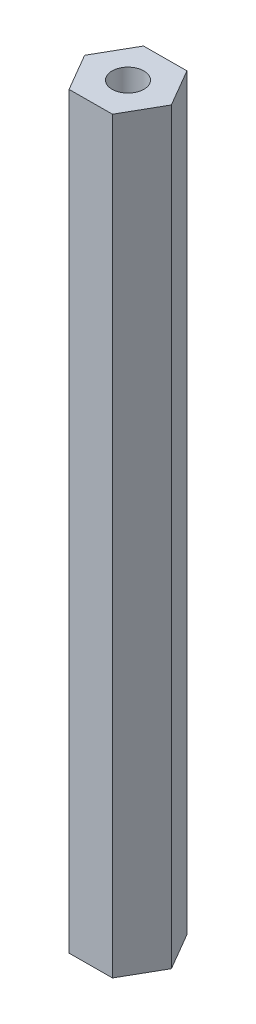
ISO-10303-21;
HEADER;
FILE_DESCRIPTION(('STEP AP214'),'2;1');
FILE_NAME('part.step','',(''),(''),'','','');
FILE_SCHEMA(('AUTOMOTIVE_DESIGN { 1 0 10303 214 1 1 1 1 }'));
ENDSEC;
DATA;
#1=APPLICATION_CONTEXT('core data for automotive mechanical design processes');
#2=APPLICATION_PROTOCOL_DEFINITION('international standard','automotive_design',2000,#1);
#3=PRODUCT_CONTEXT('',#1,'mechanical');
#4=PRODUCT('Part','Part','',(#3));
#5=PRODUCT_RELATED_PRODUCT_CATEGORY('part','',(#4));
#6=PRODUCT_DEFINITION_FORMATION('','',#4);
#7=PRODUCT_DEFINITION_CONTEXT('part definition',#1,'design');
#8=PRODUCT_DEFINITION('design','',#6,#7);
#9=PRODUCT_DEFINITION_SHAPE('','',#8);
#10=(LENGTH_UNIT() NAMED_UNIT(*) SI_UNIT(.MILLI.,.METRE.));
#11=(NAMED_UNIT(*) PLANE_ANGLE_UNIT() SI_UNIT($,.RADIAN.));
#12=(NAMED_UNIT(*) SI_UNIT($,.STERADIAN.) SOLID_ANGLE_UNIT());
#13=UNCERTAINTY_MEASURE_WITH_UNIT(LENGTH_MEASURE(1.E-05),#10,'distance_accuracy_value','');
#14=(GEOMETRIC_REPRESENTATION_CONTEXT(3) GLOBAL_UNCERTAINTY_ASSIGNED_CONTEXT((#13)) GLOBAL_UNIT_ASSIGNED_CONTEXT((#10,
#11,#12)) REPRESENTATION_CONTEXT('',''));
#15=CARTESIAN_POINT('',(0.,0.,0.));
#16=DIRECTION('',(0.,0.,1.));
#17=DIRECTION('',(1.,0.,0.));
#18=AXIS2_PLACEMENT_3D('',#15,#16,#17);
#19=CARTESIAN_POINT('',(1.81885853104389,63.5,-3.18317247056803));
#20=DIRECTION('',(0.00447565788556657,0.,0.999989984193087));
#21=DIRECTION('',(0.999989984193088,0.,-0.00447565788556657));
#22=AXIS2_PLACEMENT_3D('',#19,#20,#21);
#23=PLANE('',#22);
#24=DIRECTION('',(-0.999989984193087,0.,0.00447565788556657));
#25=VECTOR('',#24,1.);
#26=CARTESIAN_POINT('',(1.81885853104389,0.,-3.18317247056803));
#27=LINE('',#26,#25);
#28=CARTESIAN_POINT('',(1.81885853104389,0.,-3.18317247056803));
#29=VERTEX_POINT('',#28);
#30=CARTESIAN_POINT('',(-1.84727895861724,0.,-3.16676392905808));
#31=VERTEX_POINT('',#30);
#32=EDGE_CURVE('E116',#29,#31,#27,.T.);
#33=ORIENTED_EDGE('',*,*,#32,.T.);
#34=DIRECTION('',(0.,-1.,0.));
#35=VECTOR('',#34,1.);
#36=CARTESIAN_POINT('',(-1.84727895861724,63.5,-3.16676392905808));
#37=LINE('',#36,#35);
#38=CARTESIAN_POINT('',(-1.84727895861724,63.5,-3.16676392905808));
#39=VERTEX_POINT('',#38);
#40=EDGE_CURVE('E11',#39,#31,#37,.T.);
#41=ORIENTED_EDGE('',*,*,#40,.F.);
#42=DIRECTION('',(-0.999989984193087,0.,0.00447565788556657));
#43=VECTOR('',#42,1.);
#44=CARTESIAN_POINT('',(1.81885853104389,63.5,-3.18317247056803));
#45=LINE('',#44,#43);
#46=CARTESIAN_POINT('',(1.81885853104389,63.5,-3.18317247056803));
#47=VERTEX_POINT('',#46);
#48=EDGE_CURVE('E127',#47,#39,#45,.T.);
#49=ORIENTED_EDGE('',*,*,#48,.F.);
#50=DIRECTION('',(0.,-1.,0.));
#51=VECTOR('',#50,1.);
#52=CARTESIAN_POINT('',(1.81885853104389,63.5,-3.18317247056803));
#53=LINE('',#52,#51);
#54=EDGE_CURVE('E112',#47,#29,#53,.T.);
#55=ORIENTED_EDGE('',*,*,#54,.T.);
#56=EDGE_LOOP('',(#33,#41,#49,#55));
#57=FACE_BOUND('',#56,.T.);
#58=ADVANCED_FACE('F32',(#57),#23,.F.);
#59=CARTESIAN_POINT('',(-1.84727895861724,63.5,-3.16676392905808));
#60=DIRECTION('',(0.868254558783996,0.,0.496118958668995));
#61=DIRECTION('',(0.496118958668995,0.,-0.868254558783996));
#62=AXIS2_PLACEMENT_3D('',#59,#60,#61);
#63=PLANE('',#62);
#64=DIRECTION('',(-0.496118958668995,0.,0.868254558783996));
#65=VECTOR('',#64,1.);
#66=CARTESIAN_POINT('',(-1.84727895861724,0.,-3.16676392905808));
#67=LINE('',#66,#65);
#68=CARTESIAN_POINT('',(-3.66613748966113,0.,0.0164085415099574));
#69=VERTEX_POINT('',#68);
#70=EDGE_CURVE('E119',#31,#69,#67,.T.);
#71=ORIENTED_EDGE('',*,*,#70,.T.);
#72=DIRECTION('',(0.,-1.,0.));
#73=VECTOR('',#72,1.);
#74=CARTESIAN_POINT('',(-3.66613748966113,63.5,0.0164085415099574));
#75=LINE('',#74,#73);
#76=CARTESIAN_POINT('',(-3.66613748966113,63.5,0.0164085415099574));
#77=VERTEX_POINT('',#76);
#78=EDGE_CURVE('E40',#77,#69,#75,.T.);
#79=ORIENTED_EDGE('',*,*,#78,.F.);
#80=DIRECTION('',(-0.496118958668995,0.,0.868254558783996));
#81=VECTOR('',#80,1.);
#82=CARTESIAN_POINT('',(-1.84727895861724,63.5,-3.16676392905808));
#83=LINE('',#82,#81);
#84=EDGE_CURVE('E85',#39,#77,#83,.T.);
#85=ORIENTED_EDGE('',*,*,#84,.F.);
#86=ORIENTED_EDGE('',*,*,#40,.T.);
#87=EDGE_LOOP('',(#71,#79,#85,#86));
#88=FACE_BOUND('',#87,.T.);
#89=ADVANCED_FACE('F152',(#88),#63,.F.);
#90=CARTESIAN_POINT('',(-3.66613748966113,63.5,0.0164085415099574));
#91=DIRECTION('',(0.863778900898429,0.,-0.503871025524093));
#92=DIRECTION('',(-0.503871025524093,0.,-0.86377890089843));
#93=AXIS2_PLACEMENT_3D('',#90,#91,#92);
#94=PLANE('',#93);
#95=DIRECTION('',(0.503871025524093,0.,0.86377890089843));
#96=VECTOR('',#95,1.);
#97=CARTESIAN_POINT('',(-3.66613748966113,0.,0.0164085415099574));
#98=LINE('',#97,#96);
#99=CARTESIAN_POINT('',(-1.81885853104389,0.,3.18317247056804));
#100=VERTEX_POINT('',#99);
#101=EDGE_CURVE('E122',#69,#100,#98,.T.);
#102=ORIENTED_EDGE('',*,*,#101,.T.);
#103=DIRECTION('',(0.,-1.,0.));
#104=VECTOR('',#103,1.);
#105=CARTESIAN_POINT('',(-1.81885853104389,63.5,3.18317247056804));
#106=LINE('',#105,#104);
#107=CARTESIAN_POINT('',(-1.81885853104389,63.5,3.18317247056804));
#108=VERTEX_POINT('',#107);
#109=EDGE_CURVE('E107',#108,#100,#106,.T.);
#110=ORIENTED_EDGE('',*,*,#109,.F.);
#111=DIRECTION('',(0.503871025524093,0.,0.86377890089843));
#112=VECTOR('',#111,1.);
#113=CARTESIAN_POINT('',(-3.66613748966113,63.5,0.0164085415099574));
#114=LINE('',#113,#112);
#115=EDGE_CURVE('E98',#77,#108,#114,.T.);
#116=ORIENTED_EDGE('',*,*,#115,.F.);
#117=ORIENTED_EDGE('',*,*,#78,.T.);
#118=EDGE_LOOP('',(#102,#110,#116,#117));
#119=FACE_BOUND('',#118,.T.);
#120=ADVANCED_FACE('F133',(#119),#94,.F.);
#121=CARTESIAN_POINT('',(-1.81885853104389,63.5,3.18317247056804));
#122=DIRECTION('',(-0.00447565788556681,0.,-0.999989984193087));
#123=DIRECTION('',(-0.999989984193088,0.,0.00447565788556681));
#124=AXIS2_PLACEMENT_3D('',#121,#122,#123);
#125=PLANE('',#124);
#126=DIRECTION('',(0.999989984193087,0.,-0.00447565788556681));
#127=VECTOR('',#126,1.);
#128=CARTESIAN_POINT('',(-1.81885853104389,0.,3.18317247056804));
#129=LINE('',#128,#127);
#130=CARTESIAN_POINT('',(1.84727895861724,0.,3.16676392905808));
#131=VERTEX_POINT('',#130);
#132=EDGE_CURVE('E106',#100,#131,#129,.T.);
#133=ORIENTED_EDGE('',*,*,#132,.T.);
#134=DIRECTION('',(0.,-1.,0.));
#135=VECTOR('',#134,1.);
#136=CARTESIAN_POINT('',(1.84727895861724,63.5,3.16676392905808));
#137=LINE('',#136,#135);
#138=CARTESIAN_POINT('',(1.84727895861724,63.5,3.16676392905808));
#139=VERTEX_POINT('',#138);
#140=EDGE_CURVE('E103',#139,#131,#137,.T.);
#141=ORIENTED_EDGE('',*,*,#140,.F.);
#142=DIRECTION('',(0.999989984193087,0.,-0.00447565788556681));
#143=VECTOR('',#142,1.);
#144=CARTESIAN_POINT('',(-1.81885853104389,63.5,3.18317247056804));
#145=LINE('',#144,#143);
#146=EDGE_CURVE('E92',#108,#139,#145,.T.);
#147=ORIENTED_EDGE('',*,*,#146,.F.);
#148=ORIENTED_EDGE('',*,*,#109,.T.);
#149=EDGE_LOOP('',(#133,#141,#147,#148));
#150=FACE_BOUND('',#149,.T.);
#151=ADVANCED_FACE('F104',(#150),#125,.F.);
#152=CARTESIAN_POINT('',(1.84727895861724,63.5,3.16676392905808));
#153=DIRECTION('',(-0.868254558783996,0.,-0.496118958668995));
#154=DIRECTION('',(-0.496118958668995,0.,0.868254558783997));
#155=AXIS2_PLACEMENT_3D('',#152,#153,#154);
#156=PLANE('',#155);
#157=DIRECTION('',(0.496118958668995,0.,-0.868254558783996));
#158=VECTOR('',#157,1.);
#159=CARTESIAN_POINT('',(1.84727895861724,0.,3.16676392905808));
#160=LINE('',#159,#158);
#161=CARTESIAN_POINT('',(3.66613748966114,0.,-0.0164085415099599));
#162=VERTEX_POINT('',#161);
#163=EDGE_CURVE('E71',#131,#162,#160,.T.);
#164=ORIENTED_EDGE('',*,*,#163,.T.);
#165=DIRECTION('',(0.,-1.,0.));
#166=VECTOR('',#165,1.);
#167=CARTESIAN_POINT('',(3.66613748966114,63.5,-0.0164085415099599));
#168=LINE('',#167,#166);
#169=CARTESIAN_POINT('',(3.66613748966114,63.5,-0.0164085415099599));
#170=VERTEX_POINT('',#169);
#171=EDGE_CURVE('E108',#170,#162,#168,.T.);
#172=ORIENTED_EDGE('',*,*,#171,.F.);
#173=DIRECTION('',(0.496118958668995,0.,-0.868254558783996));
#174=VECTOR('',#173,1.);
#175=CARTESIAN_POINT('',(1.84727895861724,63.5,3.16676392905808));
#176=LINE('',#175,#174);
#177=EDGE_CURVE('E96',#139,#170,#176,.T.);
#178=ORIENTED_EDGE('',*,*,#177,.F.);
#179=ORIENTED_EDGE('',*,*,#140,.T.);
#180=EDGE_LOOP('',(#164,#172,#178,#179));
#181=FACE_BOUND('',#180,.T.);
#182=ADVANCED_FACE('F110',(#181),#156,.F.);
#183=CARTESIAN_POINT('',(3.66613748966114,63.5,-0.0164085415099599));
#184=DIRECTION('',(-0.86377890089843,0.,0.503871025524093));
#185=DIRECTION('',(0.503871025524093,0.,0.86377890089843));
#186=AXIS2_PLACEMENT_3D('',#183,#184,#185);
#187=PLANE('',#186);
#188=DIRECTION('',(-0.503871025524093,0.,-0.86377890089843));
#189=VECTOR('',#188,1.);
#190=CARTESIAN_POINT('',(3.66613748966114,0.,-0.0164085415099599));
#191=LINE('',#190,#189);
#192=EDGE_CURVE('E77',#162,#29,#191,.T.);
#193=ORIENTED_EDGE('',*,*,#192,.T.);
#194=ORIENTED_EDGE('',*,*,#54,.F.);
#195=DIRECTION('',(-0.503871025524093,0.,-0.86377890089843));
#196=VECTOR('',#195,1.);
#197=CARTESIAN_POINT('',(3.66613748966114,63.5,-0.0164085415099599));
#198=LINE('',#197,#196);
#199=EDGE_CURVE('E48',#170,#47,#198,.T.);
#200=ORIENTED_EDGE('',*,*,#199,.F.);
#201=ORIENTED_EDGE('',*,*,#171,.T.);
#202=EDGE_LOOP('',(#193,#194,#200,#201));
#203=FACE_BOUND('',#202,.T.);
#204=ADVANCED_FACE('F140',(#203),#187,.F.);
#205=CARTESIAN_POINT('',(0.,63.5,0.));
#206=DIRECTION('',(0.,1.,0.));
#207=DIRECTION('',(0.,0.,1.));
#208=AXIS2_PLACEMENT_3D('',#205,#206,#207);
#209=PLANE('',#208);
#210=CARTESIAN_POINT('',(0.,63.5,0.));
#211=DIRECTION('',(0.,1.,0.));
#212=DIRECTION('',(0.,0.,1.));
#213=AXIS2_PLACEMENT_3D('',#210,#211,#212);
#214=CIRCLE('',#213,1.35255);
#215=CARTESIAN_POINT('',(0.,63.5,1.35255));
#216=VERTEX_POINT('',#215);
#217=EDGE_CURVE('E207',#216,#216,#214,.T.);
#218=ORIENTED_EDGE('',*,*,#217,.F.);
#219=EDGE_LOOP('',(#218));
#220=FACE_BOUND('',#219,.T.);
#221=ORIENTED_EDGE('',*,*,#48,.T.);
#222=ORIENTED_EDGE('',*,*,#84,.T.);
#223=ORIENTED_EDGE('',*,*,#115,.T.);
#224=ORIENTED_EDGE('',*,*,#146,.T.);
#225=ORIENTED_EDGE('',*,*,#177,.T.);
#226=ORIENTED_EDGE('',*,*,#199,.T.);
#227=EDGE_LOOP('',(#221,#222,#223,#224,#225,#226));
#228=FACE_BOUND('',#227,.T.);
#229=ADVANCED_FACE('F94',(#220,#228),#209,.T.);
#230=CARTESIAN_POINT('',(0.,0.,0.));
#231=DIRECTION('',(0.,1.,0.));
#232=DIRECTION('',(0.,0.,1.));
#233=AXIS2_PLACEMENT_3D('',#230,#231,#232);
#234=PLANE('',#233);
#235=CARTESIAN_POINT('',(0.,0.,0.));
#236=DIRECTION('',(0.,1.,0.));
#237=DIRECTION('',(0.,0.,1.));
#238=AXIS2_PLACEMENT_3D('',#235,#236,#237);
#239=CIRCLE('',#238,1.35255);
#240=CARTESIAN_POINT('',(0.,0.,1.35255));
#241=VERTEX_POINT('',#240);
#242=EDGE_CURVE('E120',#241,#241,#239,.T.);
#243=ORIENTED_EDGE('',*,*,#242,.T.);
#244=EDGE_LOOP('',(#243));
#245=FACE_BOUND('',#244,.T.);
#246=ORIENTED_EDGE('',*,*,#32,.F.);
#247=ORIENTED_EDGE('',*,*,#192,.F.);
#248=ORIENTED_EDGE('',*,*,#163,.F.);
#249=ORIENTED_EDGE('',*,*,#132,.F.);
#250=ORIENTED_EDGE('',*,*,#101,.F.);
#251=ORIENTED_EDGE('',*,*,#70,.F.);
#252=EDGE_LOOP('',(#246,#247,#248,#249,#250,#251));
#253=FACE_BOUND('',#252,.T.);
#254=ADVANCED_FACE('F136',(#245,#253),#234,.F.);
#255=CARTESIAN_POINT('',(0.,0.,0.));
#256=DIRECTION('',(0.,1.,0.));
#257=DIRECTION('',(0.,0.,1.));
#258=AXIS2_PLACEMENT_3D('',#255,#256,#257);
#259=CYLINDRICAL_SURFACE('',#258,1.35255);
#260=ORIENTED_EDGE('',*,*,#242,.F.);
#261=EDGE_LOOP('',(#260));
#262=FACE_BOUND('',#261,.T.);
#263=ORIENTED_EDGE('',*,*,#217,.T.);
#264=EDGE_LOOP('',(#263));
#265=FACE_BOUND('',#264,.T.);
#266=ADVANCED_FACE('F189',(#262,#265),#259,.F.);
#267=CLOSED_SHELL('',(#58,#89,#120,#151,#182,#204,#229,#254,#266));
#268=MANIFOLD_SOLID_BREP('B2',#267);
#269=ADVANCED_BREP_SHAPE_REPRESENTATION('',(#18,#268),#14);
#270=SHAPE_DEFINITION_REPRESENTATION(#9,#269);
ENDSEC;
END-ISO-10303-21;
